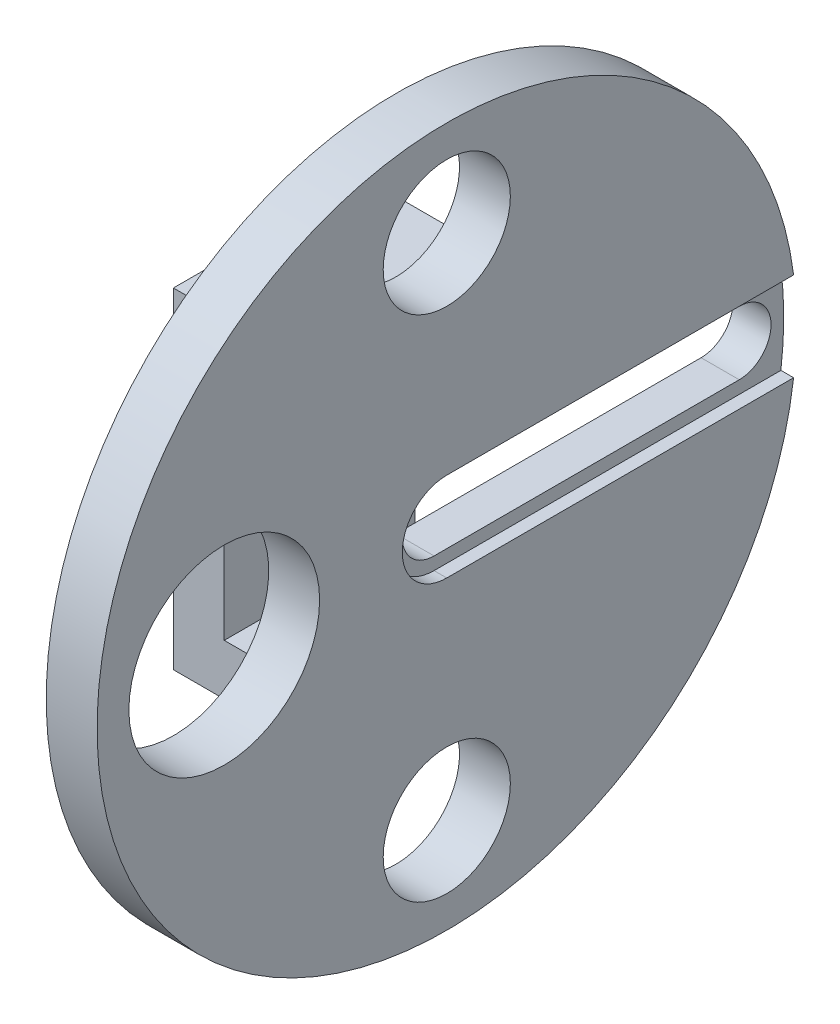
ISO-10303-21;
HEADER;
FILE_DESCRIPTION(('STEP AP214'),'2;1');
FILE_NAME('part.step','',(''),(''),'','','');
FILE_SCHEMA(('AUTOMOTIVE_DESIGN { 1 0 10303 214 1 1 1 1 }'));
ENDSEC;
DATA;
#1=APPLICATION_CONTEXT('core data for automotive mechanical design processes');
#2=APPLICATION_PROTOCOL_DEFINITION('international standard','automotive_design',2000,#1);
#3=PRODUCT_CONTEXT('',#1,'mechanical');
#4=PRODUCT('Part','Part','',(#3));
#5=PRODUCT_RELATED_PRODUCT_CATEGORY('part','',(#4));
#6=PRODUCT_DEFINITION_FORMATION('','',#4);
#7=PRODUCT_DEFINITION_CONTEXT('part definition',#1,'design');
#8=PRODUCT_DEFINITION('design','',#6,#7);
#9=PRODUCT_DEFINITION_SHAPE('','',#8);
#10=(LENGTH_UNIT() NAMED_UNIT(*) SI_UNIT(.MILLI.,.METRE.));
#11=(NAMED_UNIT(*) PLANE_ANGLE_UNIT() SI_UNIT($,.RADIAN.));
#12=(NAMED_UNIT(*) SI_UNIT($,.STERADIAN.) SOLID_ANGLE_UNIT());
#13=UNCERTAINTY_MEASURE_WITH_UNIT(LENGTH_MEASURE(1.E-05),#10,'distance_accuracy_value','');
#14=(GEOMETRIC_REPRESENTATION_CONTEXT(3) GLOBAL_UNCERTAINTY_ASSIGNED_CONTEXT((#13)) GLOBAL_UNIT_ASSIGNED_CONTEXT((#10,
#11,#12)) REPRESENTATION_CONTEXT('',''));
#15=CARTESIAN_POINT('',(0.,0.,0.));
#16=DIRECTION('',(0.,0.,1.));
#17=DIRECTION('',(1.,0.,0.));
#18=AXIS2_PLACEMENT_3D('',#15,#16,#17);
#19=CARTESIAN_POINT('',(-0.001000000000001,0.,0.));
#20=DIRECTION('',(1.,0.,0.));
#21=DIRECTION('',(0.,0.,-1.));
#22=AXIS2_PLACEMENT_3D('',#19,#20,#21);
#23=CYLINDRICAL_SURFACE('',#22,5.);
#24=CARTESIAN_POINT('',(36.,0.,0.));
#25=DIRECTION('',(1.,0.,0.));
#26=DIRECTION('',(0.,0.,-1.));
#27=AXIS2_PLACEMENT_3D('',#24,#25,#26);
#28=CIRCLE('',#27,5.);
#29=CARTESIAN_POINT('',(36.,-5.,0.));
#30=VERTEX_POINT('',#29);
#31=CARTESIAN_POINT('',(36.,5.,0.));
#32=VERTEX_POINT('',#31);
#33=EDGE_CURVE('E191',#30,#32,#28,.F.);
#34=ORIENTED_EDGE('',*,*,#33,.F.);
#35=DIRECTION('',(1.,0.,0.));
#36=VECTOR('',#35,1.);
#37=CARTESIAN_POINT('',(-0.001000000000001,-5.,0.));
#38=LINE('',#37,#36);
#39=CARTESIAN_POINT('',(30.,-5.,0.));
#40=VERTEX_POINT('',#39);
#41=EDGE_CURVE('E201',#40,#30,#38,.T.);
#42=ORIENTED_EDGE('',*,*,#41,.F.);
#43=CARTESIAN_POINT('',(30.,0.,0.));
#44=DIRECTION('',(1.,0.,0.));
#45=DIRECTION('',(0.,0.,-1.));
#46=AXIS2_PLACEMENT_3D('',#43,#44,#45);
#47=CIRCLE('',#46,5.);
#48=CARTESIAN_POINT('',(30.,5.,0.));
#49=VERTEX_POINT('',#48);
#50=EDGE_CURVE('E198',#40,#49,#47,.F.);
#51=ORIENTED_EDGE('',*,*,#50,.T.);
#52=DIRECTION('',(1.,0.,0.));
#53=VECTOR('',#52,1.);
#54=CARTESIAN_POINT('',(-0.001000000000001,5.,0.));
#55=LINE('',#54,#53);
#56=EDGE_CURVE('E202',#49,#32,#55,.T.);
#57=ORIENTED_EDGE('',*,*,#56,.T.);
#58=EDGE_LOOP('',(#34,#42,#51,#57));
#59=FACE_BOUND('',#58,.T.);
#60=ADVANCED_FACE('F35',(#59),#23,.F.);
#61=CARTESIAN_POINT('',(-0.001000000000001,5.,0.));
#62=DIRECTION('',(0.,-1.,0.));
#63=DIRECTION('',(0.,0.,-1.));
#64=AXIS2_PLACEMENT_3D('',#61,#62,#63);
#65=PLANE('',#64);
#66=DIRECTION('',(1.,0.,0.));
#67=VECTOR('',#66,1.);
#68=CARTESIAN_POINT('',(-0.001000000000001,5.,-48.));
#69=LINE('',#68,#67);
#70=CARTESIAN_POINT('',(30.,5.,-48.));
#71=VERTEX_POINT('',#70);
#72=CARTESIAN_POINT('',(36.,5.,-48.));
#73=VERTEX_POINT('',#72);
#74=EDGE_CURVE('E206',#71,#73,#69,.T.);
#75=ORIENTED_EDGE('',*,*,#74,.T.);
#76=DIRECTION('',(0.,0.,1.));
#77=VECTOR('',#76,1.);
#78=CARTESIAN_POINT('',(36.,5.,0.));
#79=LINE('',#78,#77);
#80=EDGE_CURVE('E188',#73,#32,#79,.T.);
#81=ORIENTED_EDGE('',*,*,#80,.T.);
#82=ORIENTED_EDGE('',*,*,#56,.F.);
#83=DIRECTION('',(0.,0.,1.));
#84=VECTOR('',#83,1.);
#85=CARTESIAN_POINT('',(30.,5.,0.));
#86=LINE('',#85,#84);
#87=EDGE_CURVE('E195',#71,#49,#86,.T.);
#88=ORIENTED_EDGE('',*,*,#87,.F.);
#89=EDGE_LOOP('',(#75,#81,#82,#88));
#90=FACE_BOUND('',#89,.T.);
#91=ADVANCED_FACE('F322',(#90),#65,.T.);
#92=CARTESIAN_POINT('',(-0.001000000000001,0.,-48.));
#93=DIRECTION('',(1.,0.,0.));
#94=DIRECTION('',(0.,0.,-1.));
#95=AXIS2_PLACEMENT_3D('',#92,#93,#94);
#96=CYLINDRICAL_SURFACE('',#95,5.);
#97=CARTESIAN_POINT('',(36.,0.,-48.));
#98=DIRECTION('',(1.,0.,0.));
#99=DIRECTION('',(0.,0.,-1.));
#100=AXIS2_PLACEMENT_3D('',#97,#98,#99);
#101=CIRCLE('',#100,5.);
#102=CARTESIAN_POINT('',(36.,-5.,-48.));
#103=VERTEX_POINT('',#102);
#104=EDGE_CURVE('E59',#73,#103,#101,.F.);
#105=ORIENTED_EDGE('',*,*,#104,.F.);
#106=ORIENTED_EDGE('',*,*,#74,.F.);
#107=CARTESIAN_POINT('',(30.,0.,-48.));
#108=DIRECTION('',(1.,0.,0.));
#109=DIRECTION('',(0.,0.,-1.));
#110=AXIS2_PLACEMENT_3D('',#107,#108,#109);
#111=CIRCLE('',#110,5.);
#112=CARTESIAN_POINT('',(30.,-5.,-48.));
#113=VERTEX_POINT('',#112);
#114=EDGE_CURVE('E193',#71,#113,#111,.F.);
#115=ORIENTED_EDGE('',*,*,#114,.T.);
#116=DIRECTION('',(1.,0.,0.));
#117=VECTOR('',#116,1.);
#118=CARTESIAN_POINT('',(-0.001000000000001,-5.,-48.));
#119=LINE('',#118,#117);
#120=EDGE_CURVE('E209',#113,#103,#119,.T.);
#121=ORIENTED_EDGE('',*,*,#120,.T.);
#122=EDGE_LOOP('',(#105,#106,#115,#121));
#123=FACE_BOUND('',#122,.T.);
#124=ADVANCED_FACE('F328',(#123),#96,.F.);
#125=CARTESIAN_POINT('',(-0.001000000000001,-5.,0.));
#126=DIRECTION('',(0.,-1.,0.));
#127=DIRECTION('',(0.,0.,-1.));
#128=AXIS2_PLACEMENT_3D('',#125,#126,#127);
#129=PLANE('',#128);
#130=DIRECTION('',(0.,0.,1.));
#131=VECTOR('',#130,1.);
#132=CARTESIAN_POINT('',(36.,-5.,0.));
#133=LINE('',#132,#131);
#134=EDGE_CURVE('E11',#103,#30,#133,.T.);
#135=ORIENTED_EDGE('',*,*,#134,.F.);
#136=ORIENTED_EDGE('',*,*,#120,.F.);
#137=DIRECTION('',(0.,0.,1.));
#138=VECTOR('',#137,1.);
#139=CARTESIAN_POINT('',(30.,-5.,0.));
#140=LINE('',#139,#138);
#141=EDGE_CURVE('E205',#113,#40,#140,.T.);
#142=ORIENTED_EDGE('',*,*,#141,.T.);
#143=ORIENTED_EDGE('',*,*,#41,.T.);
#144=EDGE_LOOP('',(#135,#136,#142,#143));
#145=FACE_BOUND('',#144,.T.);
#146=ADVANCED_FACE('F334',(#145),#129,.F.);
#147=CARTESIAN_POINT('',(18.,0.,0.));
#148=DIRECTION('',(-1.,0.,0.));
#149=DIRECTION('',(0.,0.,1.));
#150=AXIS2_PLACEMENT_3D('',#147,#148,#149);
#151=PLANE('',#150);
#152=CARTESIAN_POINT('',(18.,0.,0.));
#153=DIRECTION('',(-1.,0.,0.));
#154=DIRECTION('',(0.,0.,1.));
#155=AXIS2_PLACEMENT_3D('',#152,#153,#154);
#156=CIRCLE('',#155,9.);
#157=CARTESIAN_POINT('',(18.,0.,9.));
#158=VERTEX_POINT('',#157);
#159=EDGE_CURVE('E180',#158,#158,#156,.F.);
#160=ORIENTED_EDGE('',*,*,#159,.F.);
#161=EDGE_LOOP('',(#160));
#162=FACE_BOUND('',#161,.T.);
#163=DIRECTION('',(0.,0.,1.));
#164=VECTOR('',#163,1.);
#165=CARTESIAN_POINT('',(18.,-18.,15.));
#166=LINE('',#165,#164);
#167=CARTESIAN_POINT('',(18.,-18.,-15.));
#168=VERTEX_POINT('',#167);
#169=CARTESIAN_POINT('',(18.,-18.,15.));
#170=VERTEX_POINT('',#169);
#171=EDGE_CURVE('E220',#168,#170,#166,.T.);
#172=ORIENTED_EDGE('',*,*,#171,.F.);
#173=DIRECTION('',(0.,1.,0.));
#174=VECTOR('',#173,1.);
#175=CARTESIAN_POINT('',(18.,-26.,-15.));
#176=LINE('',#175,#174);
#177=CARTESIAN_POINT('',(18.,18.,-15.));
#178=VERTEX_POINT('',#177);
#179=EDGE_CURVE('E277',#168,#178,#176,.T.);
#180=ORIENTED_EDGE('',*,*,#179,.T.);
#181=DIRECTION('',(0.,0.,-1.));
#182=VECTOR('',#181,1.);
#183=CARTESIAN_POINT('',(18.,18.,15.));
#184=LINE('',#183,#182);
#185=CARTESIAN_POINT('',(18.,18.,15.));
#186=VERTEX_POINT('',#185);
#187=EDGE_CURVE('E243',#186,#178,#184,.T.);
#188=ORIENTED_EDGE('',*,*,#187,.F.);
#189=DIRECTION('',(0.,-1.,0.));
#190=VECTOR('',#189,1.);
#191=CARTESIAN_POINT('',(18.,-26.,15.));
#192=LINE('',#191,#190);
#193=EDGE_CURVE('E265',#186,#170,#192,.T.);
#194=ORIENTED_EDGE('',*,*,#193,.T.);
#195=EDGE_LOOP('',(#172,#180,#188,#194));
#196=FACE_BOUND('',#195,.T.);
#197=ADVANCED_FACE('F357',(#162,#196),#151,.F.);
#198=CARTESIAN_POINT('',(10.,0.,0.));
#199=DIRECTION('',(-1.,0.,0.));
#200=DIRECTION('',(0.,0.,1.));
#201=AXIS2_PLACEMENT_3D('',#198,#199,#200);
#202=PLANE('',#201);
#203=CARTESIAN_POINT('',(10.,0.,0.));
#204=DIRECTION('',(-1.,0.,0.));
#205=DIRECTION('',(0.,0.,1.));
#206=AXIS2_PLACEMENT_3D('',#203,#204,#205);
#207=CIRCLE('',#206,9.);
#208=CARTESIAN_POINT('',(10.,0.,9.));
#209=VERTEX_POINT('',#208);
#210=EDGE_CURVE('E174',#209,#209,#207,.F.);
#211=ORIENTED_EDGE('',*,*,#210,.T.);
#212=EDGE_LOOP('',(#211));
#213=FACE_BOUND('',#212,.T.);
#214=DIRECTION('',(0.,1.,0.));
#215=VECTOR('',#214,1.);
#216=CARTESIAN_POINT('',(10.,-26.,-15.));
#217=LINE('',#216,#215);
#218=CARTESIAN_POINT('',(10.,-26.,-15.));
#219=VERTEX_POINT('',#218);
#220=CARTESIAN_POINT('',(10.,26.,-15.));
#221=VERTEX_POINT('',#220);
#222=EDGE_CURVE('E274',#219,#221,#217,.T.);
#223=ORIENTED_EDGE('',*,*,#222,.F.);
#224=DIRECTION('',(0.,0.,-1.));
#225=VECTOR('',#224,1.);
#226=CARTESIAN_POINT('',(10.,-26.,15.));
#227=LINE('',#226,#225);
#228=CARTESIAN_POINT('',(10.,-26.,15.));
#229=VERTEX_POINT('',#228);
#230=EDGE_CURVE('E278',#229,#219,#227,.T.);
#231=ORIENTED_EDGE('',*,*,#230,.F.);
#232=DIRECTION('',(0.,-1.,0.));
#233=VECTOR('',#232,1.);
#234=CARTESIAN_POINT('',(10.,-26.,15.));
#235=LINE('',#234,#233);
#236=CARTESIAN_POINT('',(10.,26.,15.));
#237=VERTEX_POINT('',#236);
#238=EDGE_CURVE('E385',#237,#229,#235,.T.);
#239=ORIENTED_EDGE('',*,*,#238,.F.);
#240=DIRECTION('',(0.,0.,1.));
#241=VECTOR('',#240,1.);
#242=CARTESIAN_POINT('',(10.,26.,15.));
#243=LINE('',#242,#241);
#244=EDGE_CURVE('E377',#221,#237,#243,.T.);
#245=ORIENTED_EDGE('',*,*,#244,.F.);
#246=EDGE_LOOP('',(#223,#231,#239,#245));
#247=FACE_BOUND('',#246,.T.);
#248=ADVANCED_FACE('F304',(#213,#247),#202,.T.);
#249=CARTESIAN_POINT('',(18.,-26.,-15.));
#250=DIRECTION('',(0.,0.,1.));
#251=DIRECTION('',(1.,0.,0.));
#252=AXIS2_PLACEMENT_3D('',#249,#250,#251);
#253=PLANE('',#252);
#254=ORIENTED_EDGE('',*,*,#222,.T.);
#255=DIRECTION('',(-1.,0.,0.));
#256=VECTOR('',#255,1.);
#257=CARTESIAN_POINT('',(18.,26.,-15.));
#258=LINE('',#257,#256);
#259=CARTESIAN_POINT('',(30.,26.,-15.));
#260=VERTEX_POINT('',#259);
#261=EDGE_CURVE('E44',#260,#221,#258,.T.);
#262=ORIENTED_EDGE('',*,*,#261,.F.);
#263=DIRECTION('',(0.,1.,0.));
#264=VECTOR('',#263,1.);
#265=CARTESIAN_POINT('',(30.,26.,-15.));
#266=LINE('',#265,#264);
#267=CARTESIAN_POINT('',(30.,18.,-15.));
#268=VERTEX_POINT('',#267);
#269=EDGE_CURVE('E250',#268,#260,#266,.T.);
#270=ORIENTED_EDGE('',*,*,#269,.F.);
#271=DIRECTION('',(-1.,0.,0.));
#272=VECTOR('',#271,1.);
#273=CARTESIAN_POINT('',(30.,18.,-15.));
#274=LINE('',#273,#272);
#275=EDGE_CURVE('E256',#268,#178,#274,.T.);
#276=ORIENTED_EDGE('',*,*,#275,.T.);
#277=ORIENTED_EDGE('',*,*,#179,.F.);
#278=DIRECTION('',(-1.,0.,0.));
#279=VECTOR('',#278,1.);
#280=CARTESIAN_POINT('',(30.,-18.,-15.));
#281=LINE('',#280,#279);
#282=CARTESIAN_POINT('',(30.,-18.,-15.));
#283=VERTEX_POINT('',#282);
#284=EDGE_CURVE('E240',#283,#168,#281,.T.);
#285=ORIENTED_EDGE('',*,*,#284,.F.);
#286=DIRECTION('',(0.,1.,0.));
#287=VECTOR('',#286,1.);
#288=CARTESIAN_POINT('',(30.,-26.,-15.));
#289=LINE('',#288,#287);
#290=CARTESIAN_POINT('',(30.,-26.,-15.));
#291=VERTEX_POINT('',#290);
#292=EDGE_CURVE('E229',#291,#283,#289,.T.);
#293=ORIENTED_EDGE('',*,*,#292,.F.);
#294=DIRECTION('',(-1.,0.,0.));
#295=VECTOR('',#294,1.);
#296=CARTESIAN_POINT('',(18.,-26.,-15.));
#297=LINE('',#296,#295);
#298=EDGE_CURVE('E396',#291,#219,#297,.T.);
#299=ORIENTED_EDGE('',*,*,#298,.T.);
#300=EDGE_LOOP('',(#254,#262,#270,#276,#277,#285,#293,#299));
#301=FACE_BOUND('',#300,.T.);
#302=ADVANCED_FACE('F37',(#301),#253,.F.);
#303=CARTESIAN_POINT('',(18.,26.,15.));
#304=DIRECTION('',(0.,-1.,0.));
#305=DIRECTION('',(0.,0.,-1.));
#306=AXIS2_PLACEMENT_3D('',#303,#304,#305);
#307=PLANE('',#306);
#308=ORIENTED_EDGE('',*,*,#244,.T.);
#309=DIRECTION('',(-1.,0.,0.));
#310=VECTOR('',#309,1.);
#311=CARTESIAN_POINT('',(18.,26.,15.));
#312=LINE('',#311,#310);
#313=CARTESIAN_POINT('',(30.,26.,15.));
#314=VERTEX_POINT('',#313);
#315=EDGE_CURVE('E380',#314,#237,#312,.T.);
#316=ORIENTED_EDGE('',*,*,#315,.F.);
#317=DIRECTION('',(0.,0.,1.));
#318=VECTOR('',#317,1.);
#319=CARTESIAN_POINT('',(30.,26.,15.));
#320=LINE('',#319,#318);
#321=EDGE_CURVE('E253',#260,#314,#320,.T.);
#322=ORIENTED_EDGE('',*,*,#321,.F.);
#323=ORIENTED_EDGE('',*,*,#261,.T.);
#324=EDGE_LOOP('',(#308,#316,#322,#323));
#325=FACE_BOUND('',#324,.T.);
#326=ADVANCED_FACE('F368',(#325),#307,.F.);
#327=CARTESIAN_POINT('',(18.,-26.,15.));
#328=DIRECTION('',(0.,0.,-1.));
#329=DIRECTION('',(-1.,0.,0.));
#330=AXIS2_PLACEMENT_3D('',#327,#328,#329);
#331=PLANE('',#330);
#332=ORIENTED_EDGE('',*,*,#238,.T.);
#333=DIRECTION('',(-1.,0.,0.));
#334=VECTOR('',#333,1.);
#335=CARTESIAN_POINT('',(18.,-26.,15.));
#336=LINE('',#335,#334);
#337=CARTESIAN_POINT('',(30.,-26.,15.));
#338=VERTEX_POINT('',#337);
#339=EDGE_CURVE('E389',#338,#229,#336,.T.);
#340=ORIENTED_EDGE('',*,*,#339,.F.);
#341=DIRECTION('',(0.,-1.,0.));
#342=VECTOR('',#341,1.);
#343=CARTESIAN_POINT('',(30.,-26.,15.));
#344=LINE('',#343,#342);
#345=CARTESIAN_POINT('',(30.,-18.,15.));
#346=VERTEX_POINT('',#345);
#347=EDGE_CURVE('E223',#346,#338,#344,.T.);
#348=ORIENTED_EDGE('',*,*,#347,.F.);
#349=DIRECTION('',(-1.,0.,0.));
#350=VECTOR('',#349,1.);
#351=CARTESIAN_POINT('',(30.,-18.,15.));
#352=LINE('',#351,#350);
#353=EDGE_CURVE('E235',#346,#170,#352,.T.);
#354=ORIENTED_EDGE('',*,*,#353,.T.);
#355=ORIENTED_EDGE('',*,*,#193,.F.);
#356=DIRECTION('',(-1.,0.,0.));
#357=VECTOR('',#356,1.);
#358=CARTESIAN_POINT('',(30.,18.,15.));
#359=LINE('',#358,#357);
#360=CARTESIAN_POINT('',(30.,18.,15.));
#361=VERTEX_POINT('',#360);
#362=EDGE_CURVE('E269',#361,#186,#359,.T.);
#363=ORIENTED_EDGE('',*,*,#362,.F.);
#364=DIRECTION('',(0.,-1.,0.));
#365=VECTOR('',#364,1.);
#366=CARTESIAN_POINT('',(30.,26.,15.));
#367=LINE('',#366,#365);
#368=EDGE_CURVE('E244',#314,#361,#367,.T.);
#369=ORIENTED_EDGE('',*,*,#368,.F.);
#370=ORIENTED_EDGE('',*,*,#315,.T.);
#371=EDGE_LOOP('',(#332,#340,#348,#354,#355,#363,#369,#370));
#372=FACE_BOUND('',#371,.T.);
#373=ADVANCED_FACE('F365',(#372),#331,.F.);
#374=CARTESIAN_POINT('',(18.,-26.,15.));
#375=DIRECTION('',(0.,1.,0.));
#376=DIRECTION('',(0.,0.,1.));
#377=AXIS2_PLACEMENT_3D('',#374,#375,#376);
#378=PLANE('',#377);
#379=ORIENTED_EDGE('',*,*,#230,.T.);
#380=ORIENTED_EDGE('',*,*,#298,.F.);
#381=DIRECTION('',(0.,0.,-1.));
#382=VECTOR('',#381,1.);
#383=CARTESIAN_POINT('',(30.,-26.,15.));
#384=LINE('',#383,#382);
#385=EDGE_CURVE('E226',#338,#291,#384,.T.);
#386=ORIENTED_EDGE('',*,*,#385,.F.);
#387=ORIENTED_EDGE('',*,*,#339,.T.);
#388=EDGE_LOOP('',(#379,#380,#386,#387));
#389=FACE_BOUND('',#388,.T.);
#390=ADVANCED_FACE('F355',(#389),#378,.F.);
#391=CARTESIAN_POINT('',(30.,18.,15.));
#392=DIRECTION('',(0.,1.,0.));
#393=DIRECTION('',(0.,0.,1.));
#394=AXIS2_PLACEMENT_3D('',#391,#392,#393);
#395=PLANE('',#394);
#396=ORIENTED_EDGE('',*,*,#187,.T.);
#397=ORIENTED_EDGE('',*,*,#275,.F.);
#398=DIRECTION('',(0.,0.,-1.));
#399=VECTOR('',#398,1.);
#400=CARTESIAN_POINT('',(30.,18.,15.));
#401=LINE('',#400,#399);
#402=EDGE_CURVE('E247',#361,#268,#401,.T.);
#403=ORIENTED_EDGE('',*,*,#402,.F.);
#404=ORIENTED_EDGE('',*,*,#362,.T.);
#405=EDGE_LOOP('',(#396,#397,#403,#404));
#406=FACE_BOUND('',#405,.T.);
#407=ADVANCED_FACE('F351',(#406),#395,.F.);
#408=CARTESIAN_POINT('',(30.,-18.,15.));
#409=DIRECTION('',(0.,-1.,0.));
#410=DIRECTION('',(0.,0.,-1.));
#411=AXIS2_PLACEMENT_3D('',#408,#409,#410);
#412=PLANE('',#411);
#413=ORIENTED_EDGE('',*,*,#171,.T.);
#414=ORIENTED_EDGE('',*,*,#353,.F.);
#415=DIRECTION('',(0.,0.,1.));
#416=VECTOR('',#415,1.);
#417=CARTESIAN_POINT('',(30.,-18.,15.));
#418=LINE('',#417,#416);
#419=EDGE_CURVE('E232',#283,#346,#418,.T.);
#420=ORIENTED_EDGE('',*,*,#419,.F.);
#421=ORIENTED_EDGE('',*,*,#284,.T.);
#422=EDGE_LOOP('',(#413,#414,#420,#421));
#423=FACE_BOUND('',#422,.T.);
#424=ADVANCED_FACE('F344',(#423),#412,.F.);
#425=CARTESIAN_POINT('',(30.,0.,0.));
#426=DIRECTION('',(1.,0.,0.));
#427=DIRECTION('',(0.,0.,-1.));
#428=AXIS2_PLACEMENT_3D('',#425,#426,#427);
#429=PLANE('',#428);
#430=CARTESIAN_POINT('',(30.,0.,35.));
#431=DIRECTION('',(-1.,0.,0.));
#432=DIRECTION('',(0.,0.,1.));
#433=AXIS2_PLACEMENT_3D('',#430,#431,#432);
#434=CIRCLE('',#433,15.);
#435=CARTESIAN_POINT('',(30.,0.,50.));
#436=VERTEX_POINT('',#435);
#437=EDGE_CURVE('E285',#436,#436,#434,.T.);
#438=ORIENTED_EDGE('',*,*,#437,.F.);
#439=EDGE_LOOP('',(#438));
#440=FACE_BOUND('',#439,.T.);
#441=CARTESIAN_POINT('',(30.,-40.,0.));
#442=DIRECTION('',(-1.,0.,0.));
#443=DIRECTION('',(0.,0.,1.));
#444=AXIS2_PLACEMENT_3D('',#441,#442,#443);
#445=CIRCLE('',#444,10.);
#446=CARTESIAN_POINT('',(30.,-40.,10.));
#447=VERTEX_POINT('',#446);
#448=EDGE_CURVE('E290',#447,#447,#445,.T.);
#449=ORIENTED_EDGE('',*,*,#448,.F.);
#450=EDGE_LOOP('',(#449));
#451=FACE_BOUND('',#450,.T.);
#452=CARTESIAN_POINT('',(30.,40.,0.));
#453=DIRECTION('',(-1.,0.,0.));
#454=DIRECTION('',(0.,0.,1.));
#455=AXIS2_PLACEMENT_3D('',#452,#453,#454);
#456=CIRCLE('',#455,10.);
#457=CARTESIAN_POINT('',(30.,40.,10.));
#458=VERTEX_POINT('',#457);
#459=EDGE_CURVE('E282',#458,#458,#456,.T.);
#460=ORIENTED_EDGE('',*,*,#459,.F.);
#461=EDGE_LOOP('',(#460));
#462=FACE_BOUND('',#461,.T.);
#463=ORIENTED_EDGE('',*,*,#87,.T.);
#464=ORIENTED_EDGE('',*,*,#50,.F.);
#465=ORIENTED_EDGE('',*,*,#141,.F.);
#466=ORIENTED_EDGE('',*,*,#114,.F.);
#467=EDGE_LOOP('',(#463,#464,#465,#466));
#468=FACE_BOUND('',#467,.T.);
#469=ORIENTED_EDGE('',*,*,#347,.T.);
#470=ORIENTED_EDGE('',*,*,#385,.T.);
#471=ORIENTED_EDGE('',*,*,#292,.T.);
#472=ORIENTED_EDGE('',*,*,#419,.T.);
#473=EDGE_LOOP('',(#469,#470,#471,#472));
#474=FACE_BOUND('',#473,.T.);
#475=CARTESIAN_POINT('',(30.,0.,0.));
#476=DIRECTION('',(1.,0.,0.));
#477=DIRECTION('',(0.,0.,-1.));
#478=AXIS2_PLACEMENT_3D('',#475,#476,#477);
#479=CIRCLE('',#478,55.);
#480=CARTESIAN_POINT('',(30.,0.,-55.));
#481=VERTEX_POINT('',#480);
#482=EDGE_CURVE('E216',#481,#481,#479,.T.);
#483=ORIENTED_EDGE('',*,*,#482,.F.);
#484=EDGE_LOOP('',(#483));
#485=FACE_BOUND('',#484,.T.);
#486=ORIENTED_EDGE('',*,*,#402,.T.);
#487=ORIENTED_EDGE('',*,*,#269,.T.);
#488=ORIENTED_EDGE('',*,*,#321,.T.);
#489=ORIENTED_EDGE('',*,*,#368,.T.);
#490=EDGE_LOOP('',(#486,#487,#488,#489));
#491=FACE_BOUND('',#490,.T.);
#492=ADVANCED_FACE('F341',(#440,#451,#462,#468,#474,#485,#491),#429,.F.);
#493=CARTESIAN_POINT('',(38.,0.,0.));
#494=DIRECTION('',(-1.,0.,0.));
#495=DIRECTION('',(0.,0.,1.));
#496=AXIS2_PLACEMENT_3D('',#493,#494,#495);
#497=CYLINDRICAL_SURFACE('',#496,55.);
#498=CARTESIAN_POINT('',(38.,0.,0.));
#499=DIRECTION('',(1.,0.,0.));
#500=DIRECTION('',(0.,0.,-1.));
#501=AXIS2_PLACEMENT_3D('',#498,#499,#500);
#502=CIRCLE('',#501,55.);
#503=CARTESIAN_POINT('',(38.,6.99999999999998,-54.5527267879434));
#504=VERTEX_POINT('',#503);
#505=CARTESIAN_POINT('',(38.,-7.,-54.5527267879434));
#506=VERTEX_POINT('',#505);
#507=EDGE_CURVE('E217',#504,#506,#502,.T.);
#508=ORIENTED_EDGE('',*,*,#507,.F.);
#509=DIRECTION('',(1.,0.,0.));
#510=VECTOR('',#509,1.);
#511=CARTESIAN_POINT('',(36.,6.99999999999998,-54.5527267879434));
#512=LINE('',#511,#510);
#513=CARTESIAN_POINT('',(36.,6.99999999999998,-54.5527267879434));
#514=VERTEX_POINT('',#513);
#515=EDGE_CURVE('E184',#514,#504,#512,.T.);
#516=ORIENTED_EDGE('',*,*,#515,.F.);
#517=CARTESIAN_POINT('',(36.,0.,0.));
#518=DIRECTION('',(1.,0.,0.));
#519=DIRECTION('',(0.,0.,-1.));
#520=AXIS2_PLACEMENT_3D('',#517,#518,#519);
#521=CIRCLE('',#520,55.);
#522=CARTESIAN_POINT('',(36.,-7.,-54.5527267879434));
#523=VERTEX_POINT('',#522);
#524=EDGE_CURVE('E164',#523,#514,#521,.T.);
#525=ORIENTED_EDGE('',*,*,#524,.F.);
#526=DIRECTION('',(1.,0.,0.));
#527=VECTOR('',#526,1.);
#528=CARTESIAN_POINT('',(36.,-7.,-54.5527267879434));
#529=LINE('',#528,#527);
#530=EDGE_CURVE('E155',#523,#506,#529,.T.);
#531=ORIENTED_EDGE('',*,*,#530,.T.);
#532=EDGE_LOOP('',(#508,#516,#525,#531));
#533=FACE_BOUND('',#532,.T.);
#534=ORIENTED_EDGE('',*,*,#482,.T.);
#535=EDGE_LOOP('',(#534));
#536=FACE_BOUND('',#535,.T.);
#537=ADVANCED_FACE('F339',(#533,#536),#497,.T.);
#538=CARTESIAN_POINT('',(38.,0.,0.));
#539=DIRECTION('',(1.,0.,0.));
#540=DIRECTION('',(0.,0.,-1.));
#541=AXIS2_PLACEMENT_3D('',#538,#539,#540);
#542=PLANE('',#541);
#543=CARTESIAN_POINT('',(38.,0.,35.));
#544=DIRECTION('',(1.,0.,0.));
#545=DIRECTION('',(0.,0.,-1.));
#546=AXIS2_PLACEMENT_3D('',#543,#544,#545);
#547=CIRCLE('',#546,15.);
#548=CARTESIAN_POINT('',(38.,0.,19.9999999999999));
#549=VERTEX_POINT('',#548);
#550=EDGE_CURVE('E39',#549,#549,#547,.T.);
#551=ORIENTED_EDGE('',*,*,#550,.F.);
#552=EDGE_LOOP('',(#551));
#553=FACE_BOUND('',#552,.T.);
#554=CARTESIAN_POINT('',(38.,-40.,0.));
#555=DIRECTION('',(1.,0.,0.));
#556=DIRECTION('',(0.,0.,-1.));
#557=AXIS2_PLACEMENT_3D('',#554,#555,#556);
#558=CIRCLE('',#557,10.);
#559=CARTESIAN_POINT('',(38.,-40.,-10.));
#560=VERTEX_POINT('',#559);
#561=EDGE_CURVE('E283',#560,#560,#558,.T.);
#562=ORIENTED_EDGE('',*,*,#561,.F.);
#563=EDGE_LOOP('',(#562));
#564=FACE_BOUND('',#563,.T.);
#565=CARTESIAN_POINT('',(38.,40.,0.));
#566=DIRECTION('',(1.,0.,0.));
#567=DIRECTION('',(0.,0.,-1.));
#568=AXIS2_PLACEMENT_3D('',#565,#566,#567);
#569=CIRCLE('',#568,10.);
#570=CARTESIAN_POINT('',(38.,40.,-10.));
#571=VERTEX_POINT('',#570);
#572=EDGE_CURVE('E280',#571,#571,#569,.T.);
#573=ORIENTED_EDGE('',*,*,#572,.F.);
#574=EDGE_LOOP('',(#573));
#575=FACE_BOUND('',#574,.T.);
#576=DIRECTION('',(0.,0.,1.));
#577=VECTOR('',#576,1.);
#578=CARTESIAN_POINT('',(38.,7.,0.));
#579=LINE('',#578,#577);
#580=CARTESIAN_POINT('',(38.,7.,0.));
#581=VERTEX_POINT('',#580);
#582=EDGE_CURVE('E168',#504,#581,#579,.T.);
#583=ORIENTED_EDGE('',*,*,#582,.F.);
#584=ORIENTED_EDGE('',*,*,#507,.T.);
#585=DIRECTION('',(0.,0.,-1.));
#586=VECTOR('',#585,1.);
#587=CARTESIAN_POINT('',(38.,-7.,0.));
#588=LINE('',#587,#586);
#589=CARTESIAN_POINT('',(38.,-7.,0.));
#590=VERTEX_POINT('',#589);
#591=EDGE_CURVE('E171',#590,#506,#588,.T.);
#592=ORIENTED_EDGE('',*,*,#591,.F.);
#593=CARTESIAN_POINT('',(38.,0.,0.));
#594=DIRECTION('',(1.,0.,0.));
#595=DIRECTION('',(0.,0.,-1.));
#596=AXIS2_PLACEMENT_3D('',#593,#594,#595);
#597=CIRCLE('',#596,7.);
#598=EDGE_CURVE('E52',#581,#590,#597,.T.);
#599=ORIENTED_EDGE('',*,*,#598,.F.);
#600=EDGE_LOOP('',(#583,#584,#592,#599));
#601=FACE_BOUND('',#600,.T.);
#602=ADVANCED_FACE('F336',(#553,#564,#575,#601),#542,.T.);
#603=CARTESIAN_POINT('',(36.,0.,0.));
#604=DIRECTION('',(1.,0.,0.));
#605=DIRECTION('',(0.,0.,-1.));
#606=AXIS2_PLACEMENT_3D('',#603,#604,#605);
#607=PLANE('',#606);
#608=CARTESIAN_POINT('',(36.,0.,0.));
#609=DIRECTION('',(1.,0.,0.));
#610=DIRECTION('',(0.,0.,-1.));
#611=AXIS2_PLACEMENT_3D('',#608,#609,#610);
#612=CIRCLE('',#611,7.);
#613=CARTESIAN_POINT('',(36.,7.,0.));
#614=VERTEX_POINT('',#613);
#615=CARTESIAN_POINT('',(36.,-7.,0.));
#616=VERTEX_POINT('',#615);
#617=EDGE_CURVE('E151',#614,#616,#612,.T.);
#618=ORIENTED_EDGE('',*,*,#617,.T.);
#619=DIRECTION('',(0.,0.,-1.));
#620=VECTOR('',#619,1.);
#621=CARTESIAN_POINT('',(36.,-7.,0.));
#622=LINE('',#621,#620);
#623=EDGE_CURVE('E159',#616,#523,#622,.T.);
#624=ORIENTED_EDGE('',*,*,#623,.T.);
#625=ORIENTED_EDGE('',*,*,#524,.T.);
#626=DIRECTION('',(0.,0.,1.));
#627=VECTOR('',#626,1.);
#628=CARTESIAN_POINT('',(36.,7.,0.));
#629=LINE('',#628,#627);
#630=EDGE_CURVE('E156',#514,#614,#629,.T.);
#631=ORIENTED_EDGE('',*,*,#630,.T.);
#632=EDGE_LOOP('',(#618,#624,#625,#631));
#633=FACE_BOUND('',#632,.T.);
#634=ORIENTED_EDGE('',*,*,#33,.T.);
#635=ORIENTED_EDGE('',*,*,#80,.F.);
#636=ORIENTED_EDGE('',*,*,#104,.T.);
#637=ORIENTED_EDGE('',*,*,#134,.T.);
#638=EDGE_LOOP('',(#634,#635,#636,#637));
#639=FACE_BOUND('',#638,.T.);
#640=ADVANCED_FACE('F166',(#633,#639),#607,.T.);
#641=CARTESIAN_POINT('',(36.,0.,0.));
#642=DIRECTION('',(1.,0.,0.));
#643=DIRECTION('',(0.,0.,-1.));
#644=AXIS2_PLACEMENT_3D('',#641,#642,#643);
#645=CYLINDRICAL_SURFACE('',#644,7.);
#646=ORIENTED_EDGE('',*,*,#598,.T.);
#647=DIRECTION('',(1.,0.,0.));
#648=VECTOR('',#647,1.);
#649=CARTESIAN_POINT('',(36.,-7.,0.));
#650=LINE('',#649,#648);
#651=EDGE_CURVE('E147',#616,#590,#650,.T.);
#652=ORIENTED_EDGE('',*,*,#651,.F.);
#653=ORIENTED_EDGE('',*,*,#617,.F.);
#654=DIRECTION('',(1.,0.,0.));
#655=VECTOR('',#654,1.);
#656=CARTESIAN_POINT('',(36.,7.,0.));
#657=LINE('',#656,#655);
#658=EDGE_CURVE('E182',#614,#581,#657,.T.);
#659=ORIENTED_EDGE('',*,*,#658,.T.);
#660=EDGE_LOOP('',(#646,#652,#653,#659));
#661=FACE_BOUND('',#660,.T.);
#662=ADVANCED_FACE('F149',(#661),#645,.F.);
#663=CARTESIAN_POINT('',(36.,7.,0.));
#664=DIRECTION('',(0.,1.,0.));
#665=DIRECTION('',(0.,0.,1.));
#666=AXIS2_PLACEMENT_3D('',#663,#664,#665);
#667=PLANE('',#666);
#668=ORIENTED_EDGE('',*,*,#582,.T.);
#669=ORIENTED_EDGE('',*,*,#658,.F.);
#670=ORIENTED_EDGE('',*,*,#630,.F.);
#671=ORIENTED_EDGE('',*,*,#515,.T.);
#672=EDGE_LOOP('',(#668,#669,#670,#671));
#673=FACE_BOUND('',#672,.T.);
#674=ADVANCED_FACE('F318',(#673),#667,.F.);
#675=CARTESIAN_POINT('',(36.,-7.,0.));
#676=DIRECTION('',(0.,-1.,0.));
#677=DIRECTION('',(0.,0.,-1.));
#678=AXIS2_PLACEMENT_3D('',#675,#676,#677);
#679=PLANE('',#678);
#680=ORIENTED_EDGE('',*,*,#591,.T.);
#681=ORIENTED_EDGE('',*,*,#530,.F.);
#682=ORIENTED_EDGE('',*,*,#623,.F.);
#683=ORIENTED_EDGE('',*,*,#651,.T.);
#684=EDGE_LOOP('',(#680,#681,#682,#683));
#685=FACE_BOUND('',#684,.T.);
#686=ADVANCED_FACE('F160',(#685),#679,.F.);
#687=CARTESIAN_POINT('',(38.001,0.,0.));
#688=DIRECTION('',(-1.,0.,0.));
#689=DIRECTION('',(0.,0.,1.));
#690=AXIS2_PLACEMENT_3D('',#687,#688,#689);
#691=CYLINDRICAL_SURFACE('',#690,9.);
#692=ORIENTED_EDGE('',*,*,#210,.F.);
#693=EDGE_LOOP('',(#692));
#694=FACE_BOUND('',#693,.T.);
#695=ORIENTED_EDGE('',*,*,#159,.T.);
#696=EDGE_LOOP('',(#695));
#697=FACE_BOUND('',#696,.T.);
#698=ADVANCED_FACE('F307',(#694,#697),#691,.F.);
#699=CARTESIAN_POINT('',(40.,40.,0.));
#700=DIRECTION('',(-1.,0.,0.));
#701=DIRECTION('',(0.,0.,1.));
#702=AXIS2_PLACEMENT_3D('',#699,#700,#701);
#703=CYLINDRICAL_SURFACE('',#702,10.);
#704=ORIENTED_EDGE('',*,*,#572,.T.);
#705=EDGE_LOOP('',(#704));
#706=FACE_BOUND('',#705,.T.);
#707=ORIENTED_EDGE('',*,*,#459,.T.);
#708=EDGE_LOOP('',(#707));
#709=FACE_BOUND('',#708,.T.);
#710=ADVANCED_FACE('F309',(#706,#709),#703,.F.);
#711=CARTESIAN_POINT('',(40.,-40.,0.));
#712=DIRECTION('',(-1.,0.,0.));
#713=DIRECTION('',(0.,0.,1.));
#714=AXIS2_PLACEMENT_3D('',#711,#712,#713);
#715=CYLINDRICAL_SURFACE('',#714,10.);
#716=ORIENTED_EDGE('',*,*,#561,.T.);
#717=EDGE_LOOP('',(#716));
#718=FACE_BOUND('',#717,.T.);
#719=ORIENTED_EDGE('',*,*,#448,.T.);
#720=EDGE_LOOP('',(#719));
#721=FACE_BOUND('',#720,.T.);
#722=ADVANCED_FACE('F315',(#718,#721),#715,.F.);
#723=CARTESIAN_POINT('',(40.,0.,35.));
#724=DIRECTION('',(-1.,0.,0.));
#725=DIRECTION('',(0.,0.,1.));
#726=AXIS2_PLACEMENT_3D('',#723,#724,#725);
#727=CYLINDRICAL_SURFACE('',#726,15.);
#728=ORIENTED_EDGE('',*,*,#550,.T.);
#729=EDGE_LOOP('',(#728));
#730=FACE_BOUND('',#729,.T.);
#731=ORIENTED_EDGE('',*,*,#437,.T.);
#732=EDGE_LOOP('',(#731));
#733=FACE_BOUND('',#732,.T.);
#734=ADVANCED_FACE('F556',(#730,#733),#727,.F.);
#735=CLOSED_SHELL('',(#60,#91,#124,#146,#197,#248,#302,#326,#373,#390,#407,#424,#492,#537,#602,
#640,#662,#674,#686,#698,#710,#722,#734));
#736=MANIFOLD_SOLID_BREP('B2',#735);
#737=ADVANCED_BREP_SHAPE_REPRESENTATION('',(#18,#736),#14);
#738=SHAPE_DEFINITION_REPRESENTATION(#9,#737);
ENDSEC;
END-ISO-10303-21;
